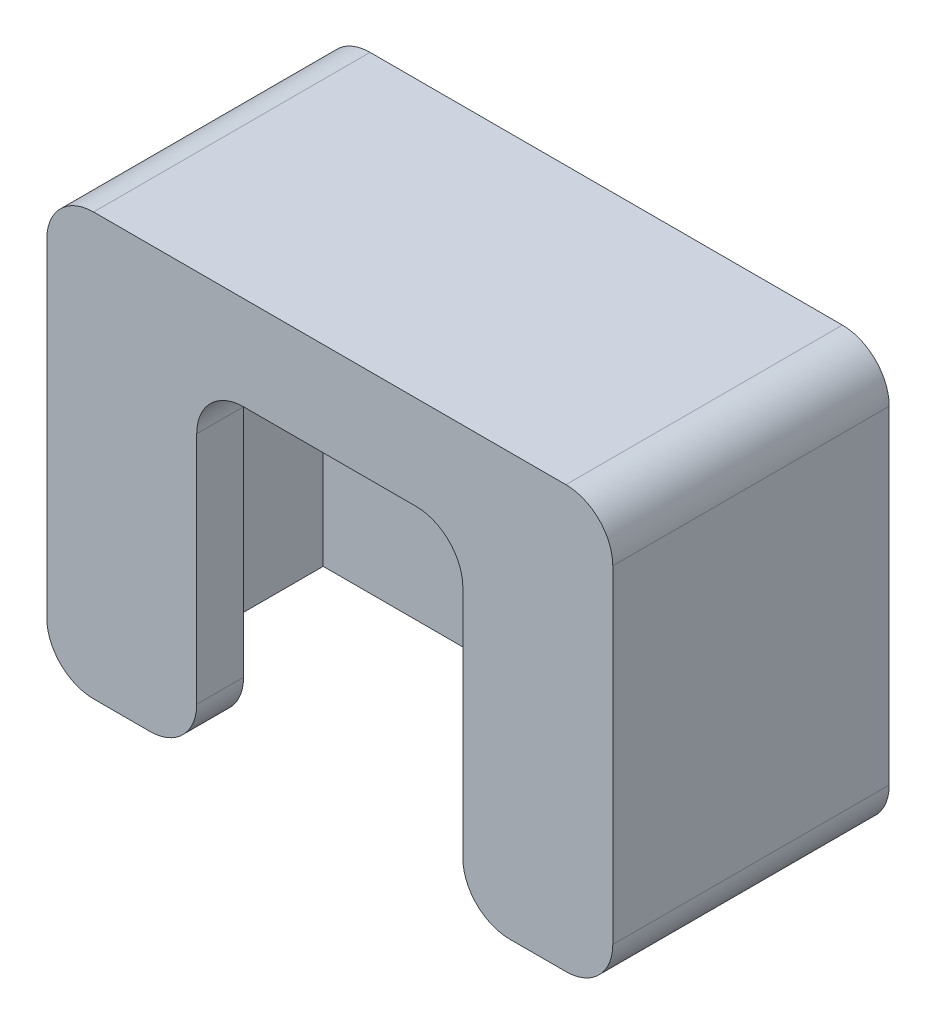
ISO-10303-21;
HEADER;
FILE_DESCRIPTION(('STEP AP214'),'2;1');
FILE_NAME('part.step','',(''),(''),'','','');
FILE_SCHEMA(('AUTOMOTIVE_DESIGN { 1 0 10303 214 1 1 1 1 }'));
ENDSEC;
DATA;
#1=APPLICATION_CONTEXT('core data for automotive mechanical design processes');
#2=APPLICATION_PROTOCOL_DEFINITION('international standard','automotive_design',2000,#1);
#3=PRODUCT_CONTEXT('',#1,'mechanical');
#4=PRODUCT('Part','Part','',(#3));
#5=PRODUCT_RELATED_PRODUCT_CATEGORY('part','',(#4));
#6=PRODUCT_DEFINITION_FORMATION('','',#4);
#7=PRODUCT_DEFINITION_CONTEXT('part definition',#1,'design');
#8=PRODUCT_DEFINITION('design','',#6,#7);
#9=PRODUCT_DEFINITION_SHAPE('','',#8);
#10=(LENGTH_UNIT() NAMED_UNIT(*) SI_UNIT(.MILLI.,.METRE.));
#11=(NAMED_UNIT(*) PLANE_ANGLE_UNIT() SI_UNIT($,.RADIAN.));
#12=(NAMED_UNIT(*) SI_UNIT($,.STERADIAN.) SOLID_ANGLE_UNIT());
#13=UNCERTAINTY_MEASURE_WITH_UNIT(LENGTH_MEASURE(1.E-05),#10,'distance_accuracy_value','');
#14=(GEOMETRIC_REPRESENTATION_CONTEXT(3) GLOBAL_UNCERTAINTY_ASSIGNED_CONTEXT((#13)) GLOBAL_UNIT_ASSIGNED_CONTEXT((#10,
#11,#12)) REPRESENTATION_CONTEXT('',''));
#15=CARTESIAN_POINT('',(0.,0.,0.));
#16=DIRECTION('',(0.,0.,1.));
#17=DIRECTION('',(1.,0.,0.));
#18=AXIS2_PLACEMENT_3D('',#15,#16,#17);
#19=CARTESIAN_POINT('',(0.,0.,0.));
#20=DIRECTION('',(0.,-1.,0.));
#21=DIRECTION('',(0.,0.,-1.));
#22=AXIS2_PLACEMENT_3D('',#19,#20,#21);
#23=PLANE('',#22);
#24=DIRECTION('',(1.,0.,0.));
#25=VECTOR('',#24,1.);
#26=CARTESIAN_POINT('',(-15.1,0.,7.375));
#27=LINE('',#26,#25);
#28=CARTESIAN_POINT('',(-12.6,0.,7.375));
#29=VERTEX_POINT('',#28);
#30=CARTESIAN_POINT('',(-9.6,0.,7.375));
#31=VERTEX_POINT('',#30);
#32=EDGE_CURVE('E263',#29,#31,#27,.T.);
#33=ORIENTED_EDGE('',*,*,#32,.F.);
#34=DIRECTION('',(0.,0.,1.));
#35=VECTOR('',#34,1.);
#36=CARTESIAN_POINT('',(-12.6,0.,-7.375));
#37=LINE('',#36,#35);
#38=CARTESIAN_POINT('',(-12.6,0.,4.875));
#39=VERTEX_POINT('',#38);
#40=EDGE_CURVE('E357',#29,#39,#37,.F.);
#41=ORIENTED_EDGE('',*,*,#40,.T.);
#42=DIRECTION('',(1.,0.,0.));
#43=VECTOR('',#42,1.);
#44=CARTESIAN_POINT('',(-12.6,0.,4.875));
#45=LINE('',#44,#43);
#46=CARTESIAN_POINT('',(-9.6,0.,4.875));
#47=VERTEX_POINT('',#46);
#48=EDGE_CURVE('E242',#39,#47,#45,.T.);
#49=ORIENTED_EDGE('',*,*,#48,.T.);
#50=DIRECTION('',(0.,0.,1.));
#51=VECTOR('',#50,1.);
#52=CARTESIAN_POINT('',(-9.6,0.,7.375));
#53=LINE('',#52,#51);
#54=EDGE_CURVE('E346',#47,#31,#53,.T.);
#55=ORIENTED_EDGE('',*,*,#54,.T.);
#56=EDGE_LOOP('',(#33,#41,#49,#55));
#57=FACE_BOUND('',#56,.T.);
#58=ADVANCED_FACE('F39',(#57),#23,.T.);
#59=DIRECTION('',(-1.,0.,0.));
#60=VECTOR('',#59,1.);
#61=CARTESIAN_POINT('',(-12.6,0.,-4.875));
#62=LINE('',#61,#60);
#63=CARTESIAN_POINT('',(12.6,0.,-4.875));
#64=VERTEX_POINT('',#63);
#65=CARTESIAN_POINT('',(-12.6,0.,-4.875));
#66=VERTEX_POINT('',#65);
#67=EDGE_CURVE('E194',#64,#66,#62,.T.);
#68=ORIENTED_EDGE('',*,*,#67,.T.);
#69=DIRECTION('',(0.,0.,1.));
#70=VECTOR('',#69,1.);
#71=CARTESIAN_POINT('',(-12.6,0.,-7.375));
#72=LINE('',#71,#70);
#73=CARTESIAN_POINT('',(-12.6,0.,-7.375));
#74=VERTEX_POINT('',#73);
#75=EDGE_CURVE('E201',#66,#74,#72,.F.);
#76=ORIENTED_EDGE('',*,*,#75,.T.);
#77=DIRECTION('',(-1.,0.,0.));
#78=VECTOR('',#77,1.);
#79=CARTESIAN_POINT('',(-15.1,0.,-7.375));
#80=LINE('',#79,#78);
#81=CARTESIAN_POINT('',(12.6,0.,-7.375));
#82=VERTEX_POINT('',#81);
#83=EDGE_CURVE('E197',#82,#74,#80,.T.);
#84=ORIENTED_EDGE('',*,*,#83,.F.);
#85=DIRECTION('',(0.,0.,-1.));
#86=VECTOR('',#85,1.);
#87=CARTESIAN_POINT('',(12.6,0.,7.375));
#88=LINE('',#87,#86);
#89=EDGE_CURVE('E190',#82,#64,#88,.F.);
#90=ORIENTED_EDGE('',*,*,#89,.T.);
#91=EDGE_LOOP('',(#68,#76,#84,#90));
#92=FACE_BOUND('',#91,.T.);
#93=ADVANCED_FACE('F192',(#92),#23,.T.);
#94=CARTESIAN_POINT('',(9.6,0.,4.875));
#95=VERTEX_POINT('',#94);
#96=CARTESIAN_POINT('',(12.6,0.,4.875));
#97=VERTEX_POINT('',#96);
#98=EDGE_CURVE('E241',#95,#97,#45,.T.);
#99=ORIENTED_EDGE('',*,*,#98,.T.);
#100=DIRECTION('',(0.,0.,-1.));
#101=VECTOR('',#100,1.);
#102=CARTESIAN_POINT('',(12.6,0.,7.375));
#103=LINE('',#102,#101);
#104=CARTESIAN_POINT('',(12.6,0.,7.375));
#105=VERTEX_POINT('',#104);
#106=EDGE_CURVE('E202',#97,#105,#103,.F.);
#107=ORIENTED_EDGE('',*,*,#106,.T.);
#108=CARTESIAN_POINT('',(9.59999999999999,0.,7.375));
#109=VERTEX_POINT('',#108);
#110=EDGE_CURVE('E259',#109,#105,#27,.T.);
#111=ORIENTED_EDGE('',*,*,#110,.F.);
#112=DIRECTION('',(0.,0.,1.));
#113=VECTOR('',#112,1.);
#114=CARTESIAN_POINT('',(9.6,0.,4.875));
#115=LINE('',#114,#113);
#116=EDGE_CURVE('E350',#109,#95,#115,.F.);
#117=ORIENTED_EDGE('',*,*,#116,.T.);
#118=EDGE_LOOP('',(#99,#107,#111,#117));
#119=FACE_BOUND('',#118,.T.);
#120=ADVANCED_FACE('F512',(#119),#23,.T.);
#121=CARTESIAN_POINT('',(-15.1,20.,-7.375));
#122=DIRECTION('',(0.,0.,1.));
#123=DIRECTION('',(1.,0.,0.));
#124=AXIS2_PLACEMENT_3D('',#121,#122,#123);
#125=PLANE('',#124);
#126=ORIENTED_EDGE('',*,*,#83,.T.);
#127=CARTESIAN_POINT('',(-12.6,2.5,-7.375));
#128=DIRECTION('',(0.,0.,1.));
#129=DIRECTION('',(1.,0.,0.));
#130=AXIS2_PLACEMENT_3D('',#127,#128,#129);
#131=CIRCLE('',#130,2.5);
#132=CARTESIAN_POINT('',(-15.1,2.5,-7.375));
#133=VERTEX_POINT('',#132);
#134=EDGE_CURVE('E363',#74,#133,#131,.F.);
#135=ORIENTED_EDGE('',*,*,#134,.T.);
#136=DIRECTION('',(0.,-1.,0.));
#137=VECTOR('',#136,1.);
#138=CARTESIAN_POINT('',(-15.1,20.,-7.375));
#139=LINE('',#138,#137);
#140=CARTESIAN_POINT('',(-15.1,20.,-7.375));
#141=VERTEX_POINT('',#140);
#142=EDGE_CURVE('E276',#141,#133,#139,.T.);
#143=ORIENTED_EDGE('',*,*,#142,.F.);
#144=CARTESIAN_POINT('',(-12.6,20.,-7.375));
#145=DIRECTION('',(0.,0.,1.));
#146=DIRECTION('',(1.,0.,0.));
#147=AXIS2_PLACEMENT_3D('',#144,#145,#146);
#148=CIRCLE('',#147,2.5);
#149=CARTESIAN_POINT('',(-12.6,22.5,-7.375));
#150=VERTEX_POINT('',#149);
#151=EDGE_CURVE('E288',#141,#150,#148,.F.);
#152=ORIENTED_EDGE('',*,*,#151,.T.);
#153=DIRECTION('',(-1.,0.,0.));
#154=VECTOR('',#153,1.);
#155=CARTESIAN_POINT('',(15.1,22.5,-7.375));
#156=LINE('',#155,#154);
#157=CARTESIAN_POINT('',(12.6,22.5,-7.375));
#158=VERTEX_POINT('',#157);
#159=EDGE_CURVE('E228',#158,#150,#156,.T.);
#160=ORIENTED_EDGE('',*,*,#159,.F.);
#161=CARTESIAN_POINT('',(12.6,20.,-7.375));
#162=DIRECTION('',(0.,0.,1.));
#163=DIRECTION('',(1.,0.,0.));
#164=AXIS2_PLACEMENT_3D('',#161,#162,#163);
#165=CIRCLE('',#164,2.5);
#166=CARTESIAN_POINT('',(15.1,20.,-7.375));
#167=VERTEX_POINT('',#166);
#168=EDGE_CURVE('E291',#158,#167,#165,.F.);
#169=ORIENTED_EDGE('',*,*,#168,.T.);
#170=DIRECTION('',(0.,-1.,0.));
#171=VECTOR('',#170,1.);
#172=CARTESIAN_POINT('',(15.1,20.,-7.375));
#173=LINE('',#172,#171);
#174=CARTESIAN_POINT('',(15.1,2.5,-7.375));
#175=VERTEX_POINT('',#174);
#176=EDGE_CURVE('E264',#167,#175,#173,.T.);
#177=ORIENTED_EDGE('',*,*,#176,.T.);
#178=CARTESIAN_POINT('',(12.6,2.5,-7.375));
#179=DIRECTION('',(0.,0.,1.));
#180=DIRECTION('',(1.,0.,0.));
#181=AXIS2_PLACEMENT_3D('',#178,#179,#180);
#182=CIRCLE('',#181,2.5);
#183=EDGE_CURVE('E360',#175,#82,#182,.F.);
#184=ORIENTED_EDGE('',*,*,#183,.T.);
#185=EDGE_LOOP('',(#126,#135,#143,#152,#160,#169,#177,#184));
#186=FACE_BOUND('',#185,.T.);
#187=ADVANCED_FACE('F468',(#186),#125,.F.);
#188=CARTESIAN_POINT('',(-15.1,20.,-7.375));
#189=DIRECTION('',(1.,0.,0.));
#190=DIRECTION('',(0.,0.,-1.));
#191=AXIS2_PLACEMENT_3D('',#188,#189,#190);
#192=PLANE('',#191);
#193=ORIENTED_EDGE('',*,*,#142,.T.);
#194=DIRECTION('',(0.,0.,1.));
#195=VECTOR('',#194,1.);
#196=CARTESIAN_POINT('',(-15.1,2.5,7.375));
#197=LINE('',#196,#195);
#198=CARTESIAN_POINT('',(-15.1,2.5,7.375));
#199=VERTEX_POINT('',#198);
#200=EDGE_CURVE('E330',#133,#199,#197,.T.);
#201=ORIENTED_EDGE('',*,*,#200,.T.);
#202=DIRECTION('',(0.,-1.,0.));
#203=VECTOR('',#202,1.);
#204=CARTESIAN_POINT('',(-15.1,20.,7.375));
#205=LINE('',#204,#203);
#206=CARTESIAN_POINT('',(-15.1,20.,7.375));
#207=VERTEX_POINT('',#206);
#208=EDGE_CURVE('E272',#207,#199,#205,.T.);
#209=ORIENTED_EDGE('',*,*,#208,.F.);
#210=DIRECTION('',(0.,0.,1.));
#211=VECTOR('',#210,1.);
#212=CARTESIAN_POINT('',(-15.1,20.,-7.375));
#213=LINE('',#212,#211);
#214=EDGE_CURVE('E303',#207,#141,#213,.F.);
#215=ORIENTED_EDGE('',*,*,#214,.T.);
#216=EDGE_LOOP('',(#193,#201,#209,#215));
#217=FACE_BOUND('',#216,.T.);
#218=ADVANCED_FACE('F491',(#217),#192,.F.);
#219=CARTESIAN_POINT('',(-15.1,20.,7.375));
#220=DIRECTION('',(0.,0.,-1.));
#221=DIRECTION('',(-1.,0.,0.));
#222=AXIS2_PLACEMENT_3D('',#219,#220,#221);
#223=PLANE('',#222);
#224=ORIENTED_EDGE('',*,*,#208,.T.);
#225=CARTESIAN_POINT('',(-12.6,2.5,7.375));
#226=DIRECTION('',(0.,0.,-1.));
#227=DIRECTION('',(-1.,0.,0.));
#228=AXIS2_PLACEMENT_3D('',#225,#226,#227);
#229=CIRCLE('',#228,2.5);
#230=EDGE_CURVE('E343',#199,#29,#229,.F.);
#231=ORIENTED_EDGE('',*,*,#230,.T.);
#232=ORIENTED_EDGE('',*,*,#32,.T.);
#233=CARTESIAN_POINT('',(-9.6,2.5,7.375));
#234=DIRECTION('',(0.,0.,-1.));
#235=DIRECTION('',(-1.,0.,0.));
#236=AXIS2_PLACEMENT_3D('',#233,#234,#235);
#237=CIRCLE('',#236,2.5);
#238=CARTESIAN_POINT('',(-7.1,2.5,7.375));
#239=VERTEX_POINT('',#238);
#240=EDGE_CURVE('E334',#31,#239,#237,.F.);
#241=ORIENTED_EDGE('',*,*,#240,.T.);
#242=DIRECTION('',(0.,-1.,0.));
#243=VECTOR('',#242,1.);
#244=CARTESIAN_POINT('',(-7.1,0.,7.375));
#245=LINE('',#244,#243);
#246=CARTESIAN_POINT('',(-7.1,15.,7.375));
#247=VERTEX_POINT('',#246);
#248=EDGE_CURVE('E408',#247,#239,#245,.T.);
#249=ORIENTED_EDGE('',*,*,#248,.F.);
#250=CARTESIAN_POINT('',(-4.6,15.,7.375));
#251=DIRECTION('',(0.,0.,-1.));
#252=DIRECTION('',(-1.,0.,0.));
#253=AXIS2_PLACEMENT_3D('',#250,#251,#252);
#254=CIRCLE('',#253,2.5);
#255=CARTESIAN_POINT('',(-4.6,17.5,7.375));
#256=VERTEX_POINT('',#255);
#257=EDGE_CURVE('E48',#247,#256,#254,.T.);
#258=ORIENTED_EDGE('',*,*,#257,.T.);
#259=DIRECTION('',(-1.,0.,0.));
#260=VECTOR('',#259,1.);
#261=CARTESIAN_POINT('',(-7.1,17.5,7.375));
#262=LINE('',#261,#260);
#263=CARTESIAN_POINT('',(4.59999999999999,17.5,7.375));
#264=VERTEX_POINT('',#263);
#265=EDGE_CURVE('E407',#264,#256,#262,.T.);
#266=ORIENTED_EDGE('',*,*,#265,.F.);
#267=CARTESIAN_POINT('',(4.6,15.,7.375));
#268=DIRECTION('',(0.,0.,-1.));
#269=DIRECTION('',(-1.,0.,0.));
#270=AXIS2_PLACEMENT_3D('',#267,#268,#269);
#271=CIRCLE('',#270,2.5);
#272=CARTESIAN_POINT('',(7.1,15.,7.375));
#273=VERTEX_POINT('',#272);
#274=EDGE_CURVE('E396',#264,#273,#271,.T.);
#275=ORIENTED_EDGE('',*,*,#274,.T.);
#276=DIRECTION('',(0.,1.,0.));
#277=VECTOR('',#276,1.);
#278=CARTESIAN_POINT('',(7.1,0.,7.375));
#279=LINE('',#278,#277);
#280=CARTESIAN_POINT('',(7.1,2.5,7.375));
#281=VERTEX_POINT('',#280);
#282=EDGE_CURVE('E418',#281,#273,#279,.T.);
#283=ORIENTED_EDGE('',*,*,#282,.F.);
#284=CARTESIAN_POINT('',(9.6,2.5,7.375));
#285=DIRECTION('',(0.,0.,-1.));
#286=DIRECTION('',(-1.,0.,0.));
#287=AXIS2_PLACEMENT_3D('',#284,#285,#286);
#288=CIRCLE('',#287,2.5);
#289=EDGE_CURVE('E337',#281,#109,#288,.F.);
#290=ORIENTED_EDGE('',*,*,#289,.T.);
#291=ORIENTED_EDGE('',*,*,#110,.T.);
#292=CARTESIAN_POINT('',(12.6,2.5,7.375));
#293=DIRECTION('',(0.,0.,-1.));
#294=DIRECTION('',(-1.,0.,0.));
#295=AXIS2_PLACEMENT_3D('',#292,#293,#294);
#296=CIRCLE('',#295,2.5);
#297=CARTESIAN_POINT('',(15.1,2.5,7.375));
#298=VERTEX_POINT('',#297);
#299=EDGE_CURVE('E340',#105,#298,#296,.F.);
#300=ORIENTED_EDGE('',*,*,#299,.T.);
#301=DIRECTION('',(0.,-1.,0.));
#302=VECTOR('',#301,1.);
#303=CARTESIAN_POINT('',(15.1,20.,7.375));
#304=LINE('',#303,#302);
#305=CARTESIAN_POINT('',(15.1,20.,7.375));
#306=VERTEX_POINT('',#305);
#307=EDGE_CURVE('E268',#306,#298,#304,.T.);
#308=ORIENTED_EDGE('',*,*,#307,.F.);
#309=CARTESIAN_POINT('',(12.6,20.,7.375));
#310=DIRECTION('',(0.,0.,-1.));
#311=DIRECTION('',(-1.,0.,0.));
#312=AXIS2_PLACEMENT_3D('',#309,#310,#311);
#313=CIRCLE('',#312,2.5);
#314=CARTESIAN_POINT('',(12.6,22.5,7.375));
#315=VERTEX_POINT('',#314);
#316=EDGE_CURVE('E300',#306,#315,#313,.F.);
#317=ORIENTED_EDGE('',*,*,#316,.T.);
#318=DIRECTION('',(1.,0.,0.));
#319=VECTOR('',#318,1.);
#320=CARTESIAN_POINT('',(-15.1,22.5,7.375));
#321=LINE('',#320,#319);
#322=CARTESIAN_POINT('',(-12.6,22.5,7.375));
#323=VERTEX_POINT('',#322);
#324=EDGE_CURVE('E232',#323,#315,#321,.T.);
#325=ORIENTED_EDGE('',*,*,#324,.F.);
#326=CARTESIAN_POINT('',(-12.6,20.,7.375));
#327=DIRECTION('',(0.,0.,-1.));
#328=DIRECTION('',(-1.,0.,0.));
#329=AXIS2_PLACEMENT_3D('',#326,#327,#328);
#330=CIRCLE('',#329,2.5);
#331=EDGE_CURVE('E297',#323,#207,#330,.F.);
#332=ORIENTED_EDGE('',*,*,#331,.T.);
#333=EDGE_LOOP('',(#224,#231,#232,#241,#249,#258,#266,#275,#283,#290,#291,#300,#308,#317,#325,#332));
#334=FACE_BOUND('',#333,.T.);
#335=ADVANCED_FACE('F406',(#334),#223,.F.);
#336=CARTESIAN_POINT('',(15.1,20.,-7.375));
#337=DIRECTION('',(-1.,0.,0.));
#338=DIRECTION('',(0.,0.,1.));
#339=AXIS2_PLACEMENT_3D('',#336,#337,#338);
#340=PLANE('',#339);
#341=ORIENTED_EDGE('',*,*,#307,.T.);
#342=DIRECTION('',(0.,0.,-1.));
#343=VECTOR('',#342,1.);
#344=CARTESIAN_POINT('',(15.1,2.5,-7.375));
#345=LINE('',#344,#343);
#346=EDGE_CURVE('E366',#298,#175,#345,.T.);
#347=ORIENTED_EDGE('',*,*,#346,.T.);
#348=ORIENTED_EDGE('',*,*,#176,.F.);
#349=DIRECTION('',(0.,0.,-1.));
#350=VECTOR('',#349,1.);
#351=CARTESIAN_POINT('',(15.1,20.,7.375));
#352=LINE('',#351,#350);
#353=EDGE_CURVE('E294',#167,#306,#352,.F.);
#354=ORIENTED_EDGE('',*,*,#353,.T.);
#355=EDGE_LOOP('',(#341,#347,#348,#354));
#356=FACE_BOUND('',#355,.T.);
#357=ADVANCED_FACE('F473',(#356),#340,.F.);
#358=CARTESIAN_POINT('',(12.6,20.,-4.875));
#359=DIRECTION('',(-1.,0.,0.));
#360=DIRECTION('',(0.,0.,1.));
#361=AXIS2_PLACEMENT_3D('',#358,#359,#360);
#362=PLANE('',#361);
#363=DIRECTION('',(0.,-1.,0.));
#364=VECTOR('',#363,1.);
#365=CARTESIAN_POINT('',(12.6,20.,4.875));
#366=LINE('',#365,#364);
#367=CARTESIAN_POINT('',(12.6,17.5,4.875));
#368=VERTEX_POINT('',#367);
#369=EDGE_CURVE('E247',#368,#97,#366,.T.);
#370=ORIENTED_EDGE('',*,*,#369,.F.);
#371=DIRECTION('',(0.,0.,-1.));
#372=VECTOR('',#371,1.);
#373=CARTESIAN_POINT('',(12.6,17.5,-4.875));
#374=LINE('',#373,#372);
#375=CARTESIAN_POINT('',(12.6,17.5,-4.875));
#376=VERTEX_POINT('',#375);
#377=EDGE_CURVE('E214',#368,#376,#374,.T.);
#378=ORIENTED_EDGE('',*,*,#377,.T.);
#379=DIRECTION('',(0.,-1.,0.));
#380=VECTOR('',#379,1.);
#381=CARTESIAN_POINT('',(12.6,20.,-4.875));
#382=LINE('',#381,#380);
#383=EDGE_CURVE('E208',#376,#64,#382,.T.);
#384=ORIENTED_EDGE('',*,*,#383,.T.);
#385=DIRECTION('',(0.,0.,-1.));
#386=VECTOR('',#385,1.);
#387=CARTESIAN_POINT('',(12.6,0.,-4.875));
#388=LINE('',#387,#386);
#389=EDGE_CURVE('E211',#97,#64,#388,.T.);
#390=ORIENTED_EDGE('',*,*,#389,.F.);
#391=EDGE_LOOP('',(#370,#378,#384,#390));
#392=FACE_BOUND('',#391,.T.);
#393=ADVANCED_FACE('F210',(#392),#362,.T.);
#394=CARTESIAN_POINT('',(-12.6,20.,-4.875));
#395=DIRECTION('',(0.,0.,1.));
#396=DIRECTION('',(1.,0.,0.));
#397=AXIS2_PLACEMENT_3D('',#394,#395,#396);
#398=PLANE('',#397);
#399=ORIENTED_EDGE('',*,*,#383,.F.);
#400=CARTESIAN_POINT('',(10.1,17.5,-4.875));
#401=DIRECTION('',(0.,0.,1.));
#402=DIRECTION('',(1.,0.,0.));
#403=AXIS2_PLACEMENT_3D('',#400,#401,#402);
#404=CIRCLE('',#403,2.5);
#405=CARTESIAN_POINT('',(10.1,20.,-4.875));
#406=VERTEX_POINT('',#405);
#407=EDGE_CURVE('E311',#376,#406,#404,.T.);
#408=ORIENTED_EDGE('',*,*,#407,.T.);
#409=DIRECTION('',(-1.,0.,0.));
#410=VECTOR('',#409,1.);
#411=CARTESIAN_POINT('',(-12.6,20.,-4.875));
#412=LINE('',#411,#410);
#413=CARTESIAN_POINT('',(-10.1,20.,-4.875));
#414=VERTEX_POINT('',#413);
#415=EDGE_CURVE('E246',#406,#414,#412,.T.);
#416=ORIENTED_EDGE('',*,*,#415,.T.);
#417=CARTESIAN_POINT('',(-10.1,17.5,-4.875));
#418=DIRECTION('',(0.,0.,1.));
#419=DIRECTION('',(1.,0.,0.));
#420=AXIS2_PLACEMENT_3D('',#417,#418,#419);
#421=CIRCLE('',#420,2.5);
#422=CARTESIAN_POINT('',(-12.6,17.5,-4.875));
#423=VERTEX_POINT('',#422);
#424=EDGE_CURVE('E308',#414,#423,#421,.T.);
#425=ORIENTED_EDGE('',*,*,#424,.T.);
#426=DIRECTION('',(0.,-1.,0.));
#427=VECTOR('',#426,1.);
#428=CARTESIAN_POINT('',(-12.6,20.,-4.875));
#429=LINE('',#428,#427);
#430=EDGE_CURVE('E217',#423,#66,#429,.T.);
#431=ORIENTED_EDGE('',*,*,#430,.T.);
#432=ORIENTED_EDGE('',*,*,#67,.F.);
#433=EDGE_LOOP('',(#399,#408,#416,#425,#431,#432));
#434=FACE_BOUND('',#433,.T.);
#435=ADVANCED_FACE('F219',(#434),#398,.T.);
#436=CARTESIAN_POINT('',(-12.6,20.,-4.875));
#437=DIRECTION('',(1.,0.,0.));
#438=DIRECTION('',(0.,0.,-1.));
#439=AXIS2_PLACEMENT_3D('',#436,#437,#438);
#440=PLANE('',#439);
#441=ORIENTED_EDGE('',*,*,#430,.F.);
#442=DIRECTION('',(0.,0.,1.));
#443=VECTOR('',#442,1.);
#444=CARTESIAN_POINT('',(-12.6,17.5,-4.875));
#445=LINE('',#444,#443);
#446=CARTESIAN_POINT('',(-12.6,17.5,4.875));
#447=VERTEX_POINT('',#446);
#448=EDGE_CURVE('E326',#423,#447,#445,.T.);
#449=ORIENTED_EDGE('',*,*,#448,.T.);
#450=DIRECTION('',(0.,-1.,0.));
#451=VECTOR('',#450,1.);
#452=CARTESIAN_POINT('',(-12.6,20.,4.875));
#453=LINE('',#452,#451);
#454=EDGE_CURVE('E251',#447,#39,#453,.T.);
#455=ORIENTED_EDGE('',*,*,#454,.T.);
#456=DIRECTION('',(0.,0.,1.));
#457=VECTOR('',#456,1.);
#458=CARTESIAN_POINT('',(-12.6,0.,-4.875));
#459=LINE('',#458,#457);
#460=EDGE_CURVE('E223',#66,#39,#459,.T.);
#461=ORIENTED_EDGE('',*,*,#460,.F.);
#462=EDGE_LOOP('',(#441,#449,#455,#461));
#463=FACE_BOUND('',#462,.T.);
#464=ADVANCED_FACE('F460',(#463),#440,.T.);
#465=CARTESIAN_POINT('',(-12.6,20.,4.875));
#466=DIRECTION('',(0.,0.,-1.));
#467=DIRECTION('',(-1.,0.,0.));
#468=AXIS2_PLACEMENT_3D('',#465,#466,#467);
#469=PLANE('',#468);
#470=ORIENTED_EDGE('',*,*,#98,.F.);
#471=CARTESIAN_POINT('',(9.6,2.5,4.875));
#472=DIRECTION('',(0.,0.,-1.));
#473=DIRECTION('',(-1.,0.,0.));
#474=AXIS2_PLACEMENT_3D('',#471,#472,#473);
#475=CIRCLE('',#474,2.5);
#476=CARTESIAN_POINT('',(7.1,2.5,4.875));
#477=VERTEX_POINT('',#476);
#478=EDGE_CURVE('E380',#95,#477,#475,.T.);
#479=ORIENTED_EDGE('',*,*,#478,.T.);
#480=DIRECTION('',(0.,1.,0.));
#481=VECTOR('',#480,1.);
#482=CARTESIAN_POINT('',(7.1,0.,4.875));
#483=LINE('',#482,#481);
#484=CARTESIAN_POINT('',(7.1,15.,4.875));
#485=VERTEX_POINT('',#484);
#486=EDGE_CURVE('E423',#477,#485,#483,.T.);
#487=ORIENTED_EDGE('',*,*,#486,.T.);
#488=CARTESIAN_POINT('',(4.6,15.,4.875));
#489=DIRECTION('',(0.,0.,-1.));
#490=DIRECTION('',(-1.,0.,0.));
#491=AXIS2_PLACEMENT_3D('',#488,#489,#490);
#492=CIRCLE('',#491,2.5);
#493=CARTESIAN_POINT('',(4.59999999999999,17.5,4.875));
#494=VERTEX_POINT('',#493);
#495=EDGE_CURVE('E399',#485,#494,#492,.F.);
#496=ORIENTED_EDGE('',*,*,#495,.T.);
#497=DIRECTION('',(-1.,0.,0.));
#498=VECTOR('',#497,1.);
#499=CARTESIAN_POINT('',(-7.1,17.5,4.875));
#500=LINE('',#499,#498);
#501=CARTESIAN_POINT('',(-4.6,17.5,4.875));
#502=VERTEX_POINT('',#501);
#503=EDGE_CURVE('E427',#494,#502,#500,.T.);
#504=ORIENTED_EDGE('',*,*,#503,.T.);
#505=CARTESIAN_POINT('',(-4.6,15.,4.875));
#506=DIRECTION('',(0.,0.,-1.));
#507=DIRECTION('',(-1.,0.,0.));
#508=AXIS2_PLACEMENT_3D('',#505,#506,#507);
#509=CIRCLE('',#508,2.5);
#510=CARTESIAN_POINT('',(-7.1,15.,4.875));
#511=VERTEX_POINT('',#510);
#512=EDGE_CURVE('E11',#502,#511,#509,.F.);
#513=ORIENTED_EDGE('',*,*,#512,.T.);
#514=DIRECTION('',(0.,-1.,0.));
#515=VECTOR('',#514,1.);
#516=CARTESIAN_POINT('',(-7.1,0.,4.875));
#517=LINE('',#516,#515);
#518=CARTESIAN_POINT('',(-7.1,2.5,4.875));
#519=VERTEX_POINT('',#518);
#520=EDGE_CURVE('E417',#511,#519,#517,.T.);
#521=ORIENTED_EDGE('',*,*,#520,.T.);
#522=CARTESIAN_POINT('',(-9.6,2.5,4.875));
#523=DIRECTION('',(0.,0.,-1.));
#524=DIRECTION('',(-1.,0.,0.));
#525=AXIS2_PLACEMENT_3D('',#522,#523,#524);
#526=CIRCLE('',#525,2.5);
#527=EDGE_CURVE('E377',#519,#47,#526,.T.);
#528=ORIENTED_EDGE('',*,*,#527,.T.);
#529=ORIENTED_EDGE('',*,*,#48,.F.);
#530=ORIENTED_EDGE('',*,*,#454,.F.);
#531=CARTESIAN_POINT('',(-10.1,17.5,4.875));
#532=DIRECTION('',(0.,0.,-1.));
#533=DIRECTION('',(-1.,0.,0.));
#534=AXIS2_PLACEMENT_3D('',#531,#532,#533);
#535=CIRCLE('',#534,2.5);
#536=CARTESIAN_POINT('',(-10.1,20.,4.875));
#537=VERTEX_POINT('',#536);
#538=EDGE_CURVE('E320',#447,#537,#535,.T.);
#539=ORIENTED_EDGE('',*,*,#538,.T.);
#540=DIRECTION('',(1.,0.,0.));
#541=VECTOR('',#540,1.);
#542=CARTESIAN_POINT('',(-12.6,20.,4.875));
#543=LINE('',#542,#541);
#544=CARTESIAN_POINT('',(10.1,20.,4.875));
#545=VERTEX_POINT('',#544);
#546=EDGE_CURVE('E235',#537,#545,#543,.T.);
#547=ORIENTED_EDGE('',*,*,#546,.T.);
#548=CARTESIAN_POINT('',(10.1,17.5,4.875));
#549=DIRECTION('',(0.,0.,-1.));
#550=DIRECTION('',(-1.,0.,0.));
#551=AXIS2_PLACEMENT_3D('',#548,#549,#550);
#552=CIRCLE('',#551,2.5);
#553=EDGE_CURVE('E323',#545,#368,#552,.T.);
#554=ORIENTED_EDGE('',*,*,#553,.T.);
#555=ORIENTED_EDGE('',*,*,#369,.T.);
#556=EDGE_LOOP('',(#470,#479,#487,#496,#504,#513,#521,#528,#529,#530,#539,#547,#554,#555));
#557=FACE_BOUND('',#556,.T.);
#558=ADVANCED_FACE('F448',(#557),#469,.T.);
#559=CARTESIAN_POINT('',(0.,20.,0.));
#560=DIRECTION('',(0.,1.,0.));
#561=DIRECTION('',(0.,0.,1.));
#562=AXIS2_PLACEMENT_3D('',#559,#560,#561);
#563=PLANE('',#562);
#564=ORIENTED_EDGE('',*,*,#415,.F.);
#565=DIRECTION('',(0.,0.,-1.));
#566=VECTOR('',#565,1.);
#567=CARTESIAN_POINT('',(10.1,20.,0.));
#568=LINE('',#567,#566);
#569=EDGE_CURVE('E317',#406,#545,#568,.F.);
#570=ORIENTED_EDGE('',*,*,#569,.T.);
#571=ORIENTED_EDGE('',*,*,#546,.F.);
#572=DIRECTION('',(0.,0.,1.));
#573=VECTOR('',#572,1.);
#574=CARTESIAN_POINT('',(-10.1,20.,0.));
#575=LINE('',#574,#573);
#576=EDGE_CURVE('E314',#537,#414,#575,.F.);
#577=ORIENTED_EDGE('',*,*,#576,.T.);
#578=EDGE_LOOP('',(#564,#570,#571,#577));
#579=FACE_BOUND('',#578,.T.);
#580=ADVANCED_FACE('F455',(#579),#563,.F.);
#581=CARTESIAN_POINT('',(0.,22.5,0.));
#582=DIRECTION('',(0.,1.,0.));
#583=DIRECTION('',(0.,0.,1.));
#584=AXIS2_PLACEMENT_3D('',#581,#582,#583);
#585=PLANE('',#584);
#586=ORIENTED_EDGE('',*,*,#324,.T.);
#587=DIRECTION('',(0.,0.,-1.));
#588=VECTOR('',#587,1.);
#589=CARTESIAN_POINT('',(12.6,22.5,-7.375));
#590=LINE('',#589,#588);
#591=EDGE_CURVE('E284',#315,#158,#590,.T.);
#592=ORIENTED_EDGE('',*,*,#591,.T.);
#593=ORIENTED_EDGE('',*,*,#159,.T.);
#594=DIRECTION('',(0.,0.,1.));
#595=VECTOR('',#594,1.);
#596=CARTESIAN_POINT('',(-12.6,22.5,7.375));
#597=LINE('',#596,#595);
#598=EDGE_CURVE('E280',#150,#323,#597,.T.);
#599=ORIENTED_EDGE('',*,*,#598,.T.);
#600=EDGE_LOOP('',(#586,#592,#593,#599));
#601=FACE_BOUND('',#600,.T.);
#602=ADVANCED_FACE('F483',(#601),#585,.T.);
#603=CARTESIAN_POINT('',(-7.1,0.,4.875));
#604=DIRECTION('',(-1.,0.,0.));
#605=DIRECTION('',(0.,0.,1.));
#606=AXIS2_PLACEMENT_3D('',#603,#604,#605);
#607=PLANE('',#606);
#608=ORIENTED_EDGE('',*,*,#248,.T.);
#609=DIRECTION('',(0.,0.,1.));
#610=VECTOR('',#609,1.);
#611=CARTESIAN_POINT('',(-7.1,2.5,4.875));
#612=LINE('',#611,#610);
#613=EDGE_CURVE('E55',#239,#519,#612,.F.);
#614=ORIENTED_EDGE('',*,*,#613,.T.);
#615=ORIENTED_EDGE('',*,*,#520,.F.);
#616=DIRECTION('',(0.,0.,1.));
#617=VECTOR('',#616,1.);
#618=CARTESIAN_POINT('',(-7.1,15.,7.375));
#619=LINE('',#618,#617);
#620=EDGE_CURVE('E383',#511,#247,#619,.T.);
#621=ORIENTED_EDGE('',*,*,#620,.T.);
#622=EDGE_LOOP('',(#608,#614,#615,#621));
#623=FACE_BOUND('',#622,.T.);
#624=ADVANCED_FACE('F420',(#623),#607,.F.);
#625=CARTESIAN_POINT('',(-7.1,17.5,4.875));
#626=DIRECTION('',(0.,1.,0.));
#627=DIRECTION('',(0.,0.,1.));
#628=AXIS2_PLACEMENT_3D('',#625,#626,#627);
#629=PLANE('',#628);
#630=ORIENTED_EDGE('',*,*,#503,.F.);
#631=DIRECTION('',(0.,0.,1.));
#632=VECTOR('',#631,1.);
#633=CARTESIAN_POINT('',(4.6,17.5,7.375));
#634=LINE('',#633,#632);
#635=EDGE_CURVE('E392',#494,#264,#634,.T.);
#636=ORIENTED_EDGE('',*,*,#635,.T.);
#637=ORIENTED_EDGE('',*,*,#265,.T.);
#638=DIRECTION('',(0.,0.,1.));
#639=VECTOR('',#638,1.);
#640=CARTESIAN_POINT('',(-4.6,17.5,4.875));
#641=LINE('',#640,#639);
#642=EDGE_CURVE('E389',#256,#502,#641,.F.);
#643=ORIENTED_EDGE('',*,*,#642,.T.);
#644=EDGE_LOOP('',(#630,#636,#637,#643));
#645=FACE_BOUND('',#644,.T.);
#646=ADVANCED_FACE('F414',(#645),#629,.F.);
#647=CARTESIAN_POINT('',(7.1,0.,4.875));
#648=DIRECTION('',(1.,0.,0.));
#649=DIRECTION('',(0.,0.,-1.));
#650=AXIS2_PLACEMENT_3D('',#647,#648,#649);
#651=PLANE('',#650);
#652=ORIENTED_EDGE('',*,*,#486,.F.);
#653=DIRECTION('',(0.,0.,1.));
#654=VECTOR('',#653,1.);
#655=CARTESIAN_POINT('',(7.1,2.5,7.375));
#656=LINE('',#655,#654);
#657=EDGE_CURVE('E373',#477,#281,#656,.T.);
#658=ORIENTED_EDGE('',*,*,#657,.T.);
#659=ORIENTED_EDGE('',*,*,#282,.T.);
#660=DIRECTION('',(0.,0.,1.));
#661=VECTOR('',#660,1.);
#662=CARTESIAN_POINT('',(7.1,15.,4.875));
#663=LINE('',#662,#661);
#664=EDGE_CURVE('E370',#273,#485,#663,.F.);
#665=ORIENTED_EDGE('',*,*,#664,.T.);
#666=EDGE_LOOP('',(#652,#658,#659,#665));
#667=FACE_BOUND('',#666,.T.);
#668=ADVANCED_FACE('F532',(#667),#651,.F.);
#669=CARTESIAN_POINT('',(12.6,20.,0.));
#670=DIRECTION('',(0.,0.,1.));
#671=DIRECTION('',(1.,0.,0.));
#672=AXIS2_PLACEMENT_3D('',#669,#670,#671);
#673=CYLINDRICAL_SURFACE('',#672,2.5);
#674=ORIENTED_EDGE('',*,*,#316,.F.);
#675=ORIENTED_EDGE('',*,*,#353,.F.);
#676=ORIENTED_EDGE('',*,*,#168,.F.);
#677=ORIENTED_EDGE('',*,*,#591,.F.);
#678=EDGE_LOOP('',(#674,#675,#676,#677));
#679=FACE_BOUND('',#678,.T.);
#680=ADVANCED_FACE('F480',(#679),#673,.T.);
#681=CARTESIAN_POINT('',(-12.6,20.,0.));
#682=DIRECTION('',(0.,0.,-1.));
#683=DIRECTION('',(-1.,0.,0.));
#684=AXIS2_PLACEMENT_3D('',#681,#682,#683);
#685=CYLINDRICAL_SURFACE('',#684,2.5);
#686=ORIENTED_EDGE('',*,*,#151,.F.);
#687=ORIENTED_EDGE('',*,*,#214,.F.);
#688=ORIENTED_EDGE('',*,*,#331,.F.);
#689=ORIENTED_EDGE('',*,*,#598,.F.);
#690=EDGE_LOOP('',(#686,#687,#688,#689));
#691=FACE_BOUND('',#690,.T.);
#692=ADVANCED_FACE('F488',(#691),#685,.T.);
#693=CARTESIAN_POINT('',(10.1,17.5,-4.875));
#694=DIRECTION('',(0.,0.,-1.));
#695=DIRECTION('',(-1.,0.,0.));
#696=AXIS2_PLACEMENT_3D('',#693,#694,#695);
#697=CYLINDRICAL_SURFACE('',#696,2.5);
#698=ORIENTED_EDGE('',*,*,#553,.F.);
#699=ORIENTED_EDGE('',*,*,#569,.F.);
#700=ORIENTED_EDGE('',*,*,#407,.F.);
#701=ORIENTED_EDGE('',*,*,#377,.F.);
#702=EDGE_LOOP('',(#698,#699,#700,#701));
#703=FACE_BOUND('',#702,.T.);
#704=ADVANCED_FACE('F454',(#703),#697,.F.);
#705=CARTESIAN_POINT('',(-10.1,17.5,-4.875));
#706=DIRECTION('',(0.,0.,1.));
#707=DIRECTION('',(1.,0.,0.));
#708=AXIS2_PLACEMENT_3D('',#705,#706,#707);
#709=CYLINDRICAL_SURFACE('',#708,2.5);
#710=ORIENTED_EDGE('',*,*,#424,.F.);
#711=ORIENTED_EDGE('',*,*,#576,.F.);
#712=ORIENTED_EDGE('',*,*,#538,.F.);
#713=ORIENTED_EDGE('',*,*,#448,.F.);
#714=EDGE_LOOP('',(#710,#711,#712,#713));
#715=FACE_BOUND('',#714,.T.);
#716=ADVANCED_FACE('F457',(#715),#709,.F.);
#717=CARTESIAN_POINT('',(-12.6,2.5,-7.375));
#718=DIRECTION('',(0.,0.,-1.));
#719=DIRECTION('',(-1.,0.,0.));
#720=AXIS2_PLACEMENT_3D('',#717,#718,#719);
#721=CYLINDRICAL_SURFACE('',#720,2.5);
#722=ORIENTED_EDGE('',*,*,#460,.T.);
#723=ORIENTED_EDGE('',*,*,#40,.F.);
#724=ORIENTED_EDGE('',*,*,#230,.F.);
#725=ORIENTED_EDGE('',*,*,#200,.F.);
#726=ORIENTED_EDGE('',*,*,#134,.F.);
#727=ORIENTED_EDGE('',*,*,#75,.F.);
#728=EDGE_LOOP('',(#722,#723,#724,#725,#726,#727));
#729=FACE_BOUND('',#728,.T.);
#730=ADVANCED_FACE('F464',(#729),#721,.T.);
#731=CARTESIAN_POINT('',(12.6,2.5,-7.375));
#732=DIRECTION('',(0.,0.,1.));
#733=DIRECTION('',(1.,0.,0.));
#734=AXIS2_PLACEMENT_3D('',#731,#732,#733);
#735=CYLINDRICAL_SURFACE('',#734,2.5);
#736=ORIENTED_EDGE('',*,*,#389,.T.);
#737=ORIENTED_EDGE('',*,*,#89,.F.);
#738=ORIENTED_EDGE('',*,*,#183,.F.);
#739=ORIENTED_EDGE('',*,*,#346,.F.);
#740=ORIENTED_EDGE('',*,*,#299,.F.);
#741=ORIENTED_EDGE('',*,*,#106,.F.);
#742=EDGE_LOOP('',(#736,#737,#738,#739,#740,#741));
#743=FACE_BOUND('',#742,.T.);
#744=ADVANCED_FACE('F225',(#743),#735,.T.);
#745=CARTESIAN_POINT('',(9.6,2.5,4.875));
#746=DIRECTION('',(0.,0.,-1.));
#747=DIRECTION('',(-1.,0.,0.));
#748=AXIS2_PLACEMENT_3D('',#745,#746,#747);
#749=CYLINDRICAL_SURFACE('',#748,2.5);
#750=ORIENTED_EDGE('',*,*,#478,.F.);
#751=ORIENTED_EDGE('',*,*,#116,.F.);
#752=ORIENTED_EDGE('',*,*,#289,.F.);
#753=ORIENTED_EDGE('',*,*,#657,.F.);
#754=EDGE_LOOP('',(#750,#751,#752,#753));
#755=FACE_BOUND('',#754,.T.);
#756=ADVANCED_FACE('F501',(#755),#749,.T.);
#757=CARTESIAN_POINT('',(-9.6,2.5,0.));
#758=DIRECTION('',(0.,0.,-1.));
#759=DIRECTION('',(-1.,0.,0.));
#760=AXIS2_PLACEMENT_3D('',#757,#758,#759);
#761=CYLINDRICAL_SURFACE('',#760,2.5);
#762=ORIENTED_EDGE('',*,*,#527,.F.);
#763=ORIENTED_EDGE('',*,*,#613,.F.);
#764=ORIENTED_EDGE('',*,*,#240,.F.);
#765=ORIENTED_EDGE('',*,*,#54,.F.);
#766=EDGE_LOOP('',(#762,#763,#764,#765));
#767=FACE_BOUND('',#766,.T.);
#768=ADVANCED_FACE('F498',(#767),#761,.T.);
#769=CARTESIAN_POINT('',(4.6,15.,4.875));
#770=DIRECTION('',(0.,0.,-1.));
#771=DIRECTION('',(-1.,0.,0.));
#772=AXIS2_PLACEMENT_3D('',#769,#770,#771);
#773=CYLINDRICAL_SURFACE('',#772,2.5);
#774=ORIENTED_EDGE('',*,*,#495,.F.);
#775=ORIENTED_EDGE('',*,*,#664,.F.);
#776=ORIENTED_EDGE('',*,*,#274,.F.);
#777=ORIENTED_EDGE('',*,*,#635,.F.);
#778=EDGE_LOOP('',(#774,#775,#776,#777));
#779=FACE_BOUND('',#778,.T.);
#780=ADVANCED_FACE('F500',(#779),#773,.F.);
#781=CARTESIAN_POINT('',(-4.6,15.,4.875));
#782=DIRECTION('',(0.,0.,-1.));
#783=DIRECTION('',(-1.,0.,0.));
#784=AXIS2_PLACEMENT_3D('',#781,#782,#783);
#785=CYLINDRICAL_SURFACE('',#784,2.5);
#786=ORIENTED_EDGE('',*,*,#512,.F.);
#787=ORIENTED_EDGE('',*,*,#642,.F.);
#788=ORIENTED_EDGE('',*,*,#257,.F.);
#789=ORIENTED_EDGE('',*,*,#620,.F.);
#790=EDGE_LOOP('',(#786,#787,#788,#789));
#791=FACE_BOUND('',#790,.T.);
#792=ADVANCED_FACE('F41',(#791),#785,.F.);
#793=CLOSED_SHELL('',(#58,#93,#120,#187,#218,#335,#357,#393,#435,#464,#558,#580,#602,#624,#646,
#668,#680,#692,#704,#716,#730,#744,#756,#768,#780,#792));
#794=MANIFOLD_SOLID_BREP('B2',#793);
#795=ADVANCED_BREP_SHAPE_REPRESENTATION('',(#18,#794),#14);
#796=SHAPE_DEFINITION_REPRESENTATION(#9,#795);
ENDSEC;
END-ISO-10303-21;
